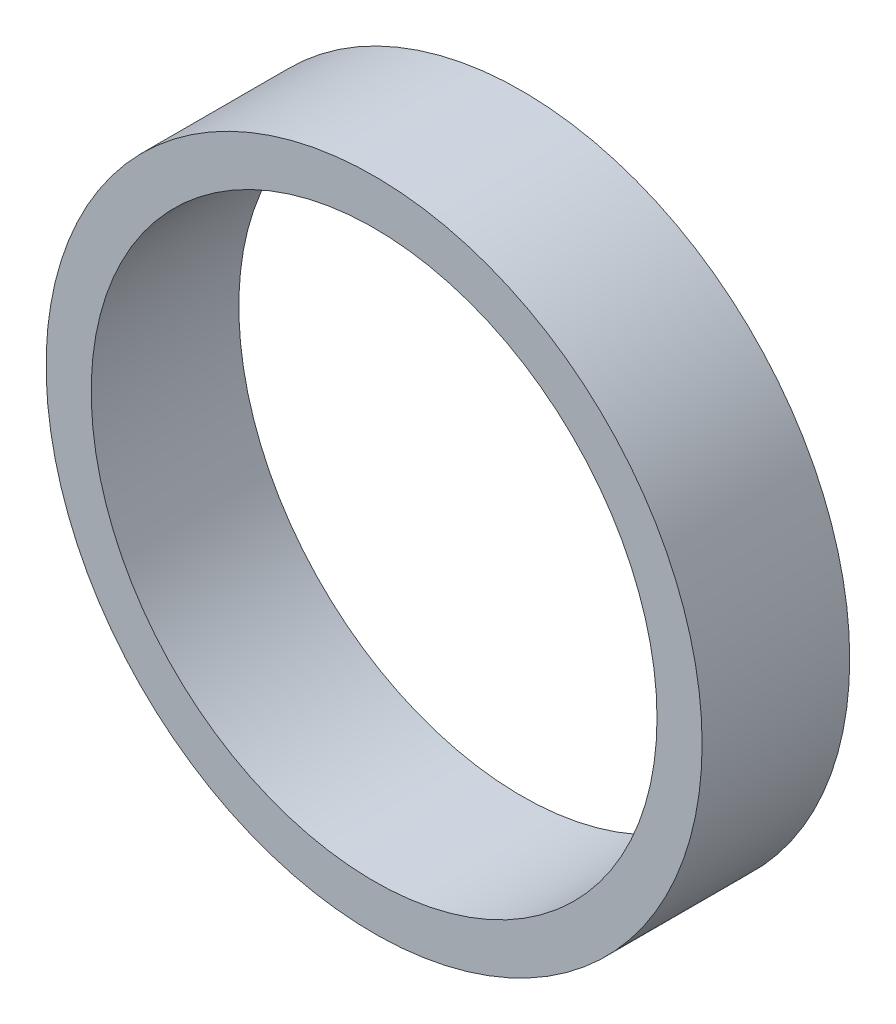
ISO-10303-21;
HEADER;
FILE_DESCRIPTION(('STEP AP214'),'2;1');
FILE_NAME('part.step','',(''),(''),'','','');
FILE_SCHEMA(('AUTOMOTIVE_DESIGN { 1 0 10303 214 1 1 1 1 }'));
ENDSEC;
DATA;
#1=APPLICATION_CONTEXT('core data for automotive mechanical design processes');
#2=APPLICATION_PROTOCOL_DEFINITION('international standard','automotive_design',2000,#1);
#3=PRODUCT_CONTEXT('',#1,'mechanical');
#4=PRODUCT('Part','Part','',(#3));
#5=PRODUCT_RELATED_PRODUCT_CATEGORY('part','',(#4));
#6=PRODUCT_DEFINITION_FORMATION('','',#4);
#7=PRODUCT_DEFINITION_CONTEXT('part definition',#1,'design');
#8=PRODUCT_DEFINITION('design','',#6,#7);
#9=PRODUCT_DEFINITION_SHAPE('','',#8);
#10=(LENGTH_UNIT() NAMED_UNIT(*) SI_UNIT(.MILLI.,.METRE.));
#11=(NAMED_UNIT(*) PLANE_ANGLE_UNIT() SI_UNIT($,.RADIAN.));
#12=(NAMED_UNIT(*) SI_UNIT($,.STERADIAN.) SOLID_ANGLE_UNIT());
#13=UNCERTAINTY_MEASURE_WITH_UNIT(LENGTH_MEASURE(1.E-05),#10,'distance_accuracy_value','');
#14=(GEOMETRIC_REPRESENTATION_CONTEXT(3) GLOBAL_UNCERTAINTY_ASSIGNED_CONTEXT((#13)) GLOBAL_UNIT_ASSIGNED_CONTEXT((#10,
#11,#12)) REPRESENTATION_CONTEXT('',''));
#15=CARTESIAN_POINT('',(0.,0.,0.));
#16=DIRECTION('',(0.,0.,1.));
#17=DIRECTION('',(1.,0.,0.));
#18=AXIS2_PLACEMENT_3D('',#15,#16,#17);
#19=CARTESIAN_POINT('',(0.,0.,4.5));
#20=DIRECTION('',(0.,0.,-1.));
#21=DIRECTION('',(-1.,0.,0.));
#22=AXIS2_PLACEMENT_3D('',#19,#20,#21);
#23=CYLINDRICAL_SURFACE('',#22,20.);
#24=CARTESIAN_POINT('',(0.,0.,4.5));
#25=DIRECTION('',(0.,0.,1.));
#26=DIRECTION('',(1.,0.,0.));
#27=AXIS2_PLACEMENT_3D('',#24,#25,#26);
#28=CIRCLE('',#27,20.);
#29=CARTESIAN_POINT('',(20.,0.,4.5));
#30=VERTEX_POINT('',#29);
#31=EDGE_CURVE('E10',#30,#30,#28,.T.);
#32=ORIENTED_EDGE('',*,*,#31,.F.);
#33=EDGE_LOOP('',(#32));
#34=FACE_BOUND('',#33,.T.);
#35=CARTESIAN_POINT('',(0.,0.,-4.5));
#36=DIRECTION('',(0.,0.,1.));
#37=DIRECTION('',(1.,0.,0.));
#38=AXIS2_PLACEMENT_3D('',#35,#36,#37);
#39=CIRCLE('',#38,20.);
#40=CARTESIAN_POINT('',(20.,0.,-4.5));
#41=VERTEX_POINT('',#40);
#42=EDGE_CURVE('E34',#41,#41,#39,.T.);
#43=ORIENTED_EDGE('',*,*,#42,.T.);
#44=EDGE_LOOP('',(#43));
#45=FACE_BOUND('',#44,.T.);
#46=ADVANCED_FACE('F31',(#34,#45),#23,.T.);
#47=CARTESIAN_POINT('',(0.,0.,4.5));
#48=DIRECTION('',(0.,0.,1.));
#49=DIRECTION('',(1.,0.,0.));
#50=AXIS2_PLACEMENT_3D('',#47,#48,#49);
#51=PLANE('',#50);
#52=CARTESIAN_POINT('',(0.,0.,4.5));
#53=DIRECTION('',(0.,0.,1.));
#54=DIRECTION('',(1.,0.,0.));
#55=AXIS2_PLACEMENT_3D('',#52,#53,#54);
#56=CIRCLE('',#55,17.25);
#57=CARTESIAN_POINT('',(17.25,0.,4.5));
#58=VERTEX_POINT('',#57);
#59=EDGE_CURVE('E43',#58,#58,#56,.T.);
#60=ORIENTED_EDGE('',*,*,#59,.F.);
#61=EDGE_LOOP('',(#60));
#62=FACE_BOUND('',#61,.T.);
#63=ORIENTED_EDGE('',*,*,#31,.T.);
#64=EDGE_LOOP('',(#63));
#65=FACE_BOUND('',#64,.T.);
#66=ADVANCED_FACE('F58',(#62,#65),#51,.T.);
#67=CARTESIAN_POINT('',(0.,0.,-4.5));
#68=DIRECTION('',(0.,0.,1.));
#69=DIRECTION('',(1.,0.,0.));
#70=AXIS2_PLACEMENT_3D('',#67,#68,#69);
#71=PLANE('',#70);
#72=CARTESIAN_POINT('',(0.,0.,-4.5));
#73=DIRECTION('',(0.,0.,1.));
#74=DIRECTION('',(1.,0.,0.));
#75=AXIS2_PLACEMENT_3D('',#72,#73,#74);
#76=CIRCLE('',#75,17.25);
#77=CARTESIAN_POINT('',(17.25,0.,-4.5));
#78=VERTEX_POINT('',#77);
#79=EDGE_CURVE('E41',#78,#78,#76,.T.);
#80=ORIENTED_EDGE('',*,*,#79,.T.);
#81=EDGE_LOOP('',(#80));
#82=FACE_BOUND('',#81,.T.);
#83=ORIENTED_EDGE('',*,*,#42,.F.);
#84=EDGE_LOOP('',(#83));
#85=FACE_BOUND('',#84,.T.);
#86=ADVANCED_FACE('F49',(#82,#85),#71,.F.);
#87=CARTESIAN_POINT('',(0.,0.,-4.5));
#88=DIRECTION('',(0.,0.,1.));
#89=DIRECTION('',(1.,0.,0.));
#90=AXIS2_PLACEMENT_3D('',#87,#88,#89);
#91=CYLINDRICAL_SURFACE('',#90,17.25);
#92=ORIENTED_EDGE('',*,*,#79,.F.);
#93=EDGE_LOOP('',(#92));
#94=FACE_BOUND('',#93,.T.);
#95=ORIENTED_EDGE('',*,*,#59,.T.);
#96=EDGE_LOOP('',(#95));
#97=FACE_BOUND('',#96,.T.);
#98=ADVANCED_FACE('F52',(#94,#97),#91,.F.);
#99=CLOSED_SHELL('',(#46,#66,#86,#98));
#100=MANIFOLD_SOLID_BREP('B2',#99);
#101=ADVANCED_BREP_SHAPE_REPRESENTATION('',(#18,#100),#14);
#102=SHAPE_DEFINITION_REPRESENTATION(#9,#101);
ENDSEC;
END-ISO-10303-21;
